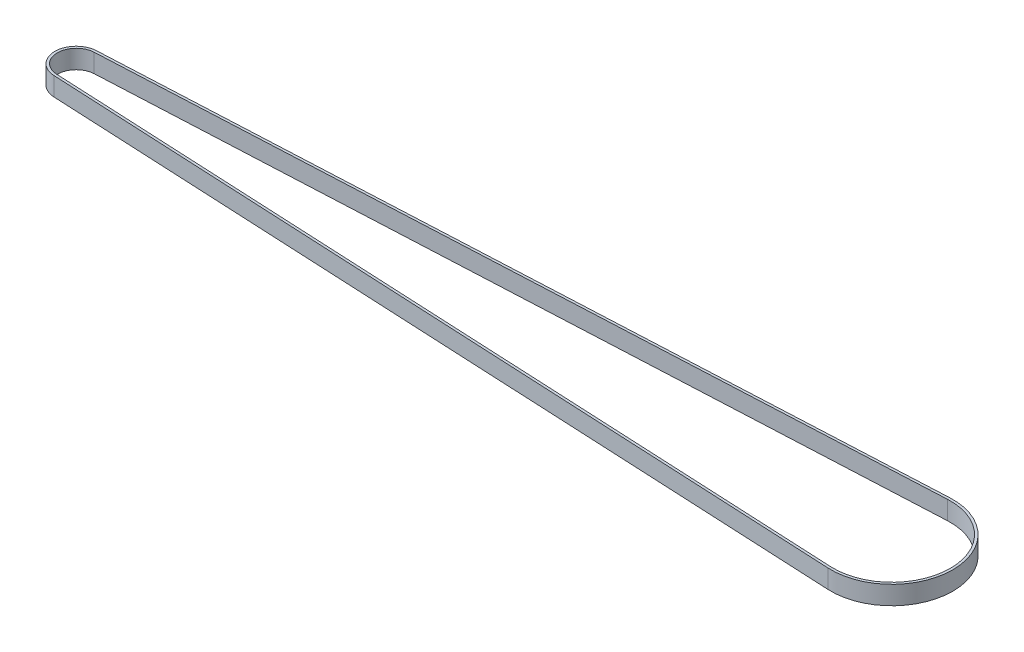
ISO-10303-21;
HEADER;
FILE_DESCRIPTION(('STEP AP214'),'2;1');
FILE_NAME('part.step','',(''),(''),'','','');
FILE_SCHEMA(('AUTOMOTIVE_DESIGN { 1 0 10303 214 1 1 1 1 }'));
ENDSEC;
DATA;
#1=APPLICATION_CONTEXT('core data for automotive mechanical design processes');
#2=APPLICATION_PROTOCOL_DEFINITION('international standard','automotive_design',2000,#1);
#3=PRODUCT_CONTEXT('',#1,'mechanical');
#4=PRODUCT('Part','Part','',(#3));
#5=PRODUCT_RELATED_PRODUCT_CATEGORY('part','',(#4));
#6=PRODUCT_DEFINITION_FORMATION('','',#4);
#7=PRODUCT_DEFINITION_CONTEXT('part definition',#1,'design');
#8=PRODUCT_DEFINITION('design','',#6,#7);
#9=PRODUCT_DEFINITION_SHAPE('','',#8);
#10=(LENGTH_UNIT() NAMED_UNIT(*) SI_UNIT(.MILLI.,.METRE.));
#11=(NAMED_UNIT(*) PLANE_ANGLE_UNIT() SI_UNIT($,.RADIAN.));
#12=(NAMED_UNIT(*) SI_UNIT($,.STERADIAN.) SOLID_ANGLE_UNIT());
#13=UNCERTAINTY_MEASURE_WITH_UNIT(LENGTH_MEASURE(1.E-05),#10,'distance_accuracy_value','');
#14=(GEOMETRIC_REPRESENTATION_CONTEXT(3) GLOBAL_UNCERTAINTY_ASSIGNED_CONTEXT((#13)) GLOBAL_UNIT_ASSIGNED_CONTEXT((#10,
#11,#12)) REPRESENTATION_CONTEXT('',''));
#15=CARTESIAN_POINT('',(0.,0.,0.));
#16=DIRECTION('',(0.,0.,1.));
#17=DIRECTION('',(1.,0.,0.));
#18=AXIS2_PLACEMENT_3D('',#15,#16,#17);
#19=CARTESIAN_POINT('',(263.,6.,0.));
#20=DIRECTION('',(0.,-1.,0.));
#21=DIRECTION('',(0.,0.,-1.));
#22=AXIS2_PLACEMENT_3D('',#19,#20,#21);
#23=PLANE('',#22);
#24=CARTESIAN_POINT('',(263.,6.,0.));
#25=DIRECTION('',(0.,1.,0.));
#26=DIRECTION('',(0.,0.,-1.));
#27=AXIS2_PLACEMENT_3D('',#24,#25,#26);
#28=CIRCLE('',#27,19.65);
#29=CARTESIAN_POINT('',(262.047385931559,6.,19.6268954864647));
#30=VERTEX_POINT('',#29);
#31=CARTESIAN_POINT('',(262.047385931559,6.,-19.6268954864647));
#32=VERTEX_POINT('',#31);
#33=EDGE_CURVE('E139',#30,#32,#28,.T.);
#34=ORIENTED_EDGE('',*,*,#33,.T.);
#35=DIRECTION('',(-0.998824197784463,0.,0.0484790874524715));
#36=VECTOR('',#35,1.);
#37=CARTESIAN_POINT('',(-0.334505703422054,6.,-6.89188696471279));
#38=LINE('',#37,#36);
#39=CARTESIAN_POINT('',(-0.334505703422054,6.,-6.89188696471279));
#40=VERTEX_POINT('',#39);
#41=EDGE_CURVE('E142',#32,#40,#38,.T.);
#42=ORIENTED_EDGE('',*,*,#41,.T.);
#43=CARTESIAN_POINT('',(0.,6.,0.));
#44=DIRECTION('',(0.,1.,0.));
#45=DIRECTION('',(0.,0.,1.));
#46=AXIS2_PLACEMENT_3D('',#43,#44,#45);
#47=CIRCLE('',#46,6.9);
#48=CARTESIAN_POINT('',(-0.334505703422057,6.,6.89188696471279));
#49=VERTEX_POINT('',#48);
#50=EDGE_CURVE('E145',#40,#49,#47,.T.);
#51=ORIENTED_EDGE('',*,*,#50,.T.);
#52=DIRECTION('',(0.998824197784463,0.,0.0484790874524715));
#53=VECTOR('',#52,1.);
#54=CARTESIAN_POINT('',(-0.334505703422053,6.,6.89188696471279));
#55=LINE('',#54,#53);
#56=EDGE_CURVE('E147',#49,#30,#55,.T.);
#57=ORIENTED_EDGE('',*,*,#56,.T.);
#58=EDGE_LOOP('',(#34,#42,#51,#57));
#59=FACE_BOUND('',#58,.T.);
#60=CARTESIAN_POINT('',(0.,6.,0.));
#61=DIRECTION('',(0.,1.,0.));
#62=DIRECTION('',(0.,0.,1.));
#63=AXIS2_PLACEMENT_3D('',#60,#61,#62);
#64=CIRCLE('',#63,6.1);
#65=CARTESIAN_POINT('',(-0.295722433460076,6.,-6.09282760648522));
#66=VERTEX_POINT('',#65);
#67=CARTESIAN_POINT('',(-0.295722433460076,6.,6.09282760648522));
#68=VERTEX_POINT('',#67);
#69=EDGE_CURVE('E103',#66,#68,#64,.T.);
#70=ORIENTED_EDGE('',*,*,#69,.F.);
#71=DIRECTION('',(-0.998824197784463,0.,0.0484790874524715));
#72=VECTOR('',#71,1.);
#73=CARTESIAN_POINT('',(-0.295722433460076,6.,-6.09282760648522));
#74=LINE('',#73,#72);
#75=CARTESIAN_POINT('',(262.086169201521,6.,-18.8278361282371));
#76=VERTEX_POINT('',#75);
#77=EDGE_CURVE('E125',#76,#66,#74,.T.);
#78=ORIENTED_EDGE('',*,*,#77,.F.);
#79=CARTESIAN_POINT('',(263.,6.,0.));
#80=DIRECTION('',(0.,1.,0.));
#81=DIRECTION('',(0.,0.,-1.));
#82=AXIS2_PLACEMENT_3D('',#79,#80,#81);
#83=CIRCLE('',#82,18.85);
#84=CARTESIAN_POINT('',(262.086169201521,6.,18.8278361282371));
#85=VERTEX_POINT('',#84);
#86=EDGE_CURVE('E123',#85,#76,#83,.T.);
#87=ORIENTED_EDGE('',*,*,#86,.F.);
#88=DIRECTION('',(0.998824197784463,0.,0.0484790874524715));
#89=VECTOR('',#88,1.);
#90=CARTESIAN_POINT('',(-0.295722433460076,6.,6.09282760648522));
#91=LINE('',#90,#89);
#92=EDGE_CURVE('E111',#68,#85,#91,.T.);
#93=ORIENTED_EDGE('',*,*,#92,.F.);
#94=EDGE_LOOP('',(#70,#78,#87,#93));
#95=FACE_BOUND('',#94,.T.);
#96=ADVANCED_FACE('F38',(#59,#95),#23,.F.);
#97=CARTESIAN_POINT('',(263.,0.,0.));
#98=DIRECTION('',(0.,-1.,0.));
#99=DIRECTION('',(0.,0.,-1.));
#100=AXIS2_PLACEMENT_3D('',#97,#98,#99);
#101=PLANE('',#100);
#102=CARTESIAN_POINT('',(263.,0.,0.));
#103=DIRECTION('',(0.,1.,0.));
#104=DIRECTION('',(0.,0.,-1.));
#105=AXIS2_PLACEMENT_3D('',#102,#103,#104);
#106=CIRCLE('',#105,19.65);
#107=CARTESIAN_POINT('',(262.047385931559,0.,19.6268954864647));
#108=VERTEX_POINT('',#107);
#109=CARTESIAN_POINT('',(262.047385931559,0.,-19.6268954864647));
#110=VERTEX_POINT('',#109);
#111=EDGE_CURVE('E119',#108,#110,#106,.T.);
#112=ORIENTED_EDGE('',*,*,#111,.F.);
#113=DIRECTION('',(0.998824197784463,0.,0.0484790874524715));
#114=VECTOR('',#113,1.);
#115=CARTESIAN_POINT('',(-0.334505703422053,0.,6.89188696471279));
#116=LINE('',#115,#114);
#117=CARTESIAN_POINT('',(-0.334505703422057,0.,6.89188696471279));
#118=VERTEX_POINT('',#117);
#119=EDGE_CURVE('E143',#118,#108,#116,.T.);
#120=ORIENTED_EDGE('',*,*,#119,.F.);
#121=CARTESIAN_POINT('',(0.,0.,0.));
#122=DIRECTION('',(0.,1.,0.));
#123=DIRECTION('',(0.,0.,1.));
#124=AXIS2_PLACEMENT_3D('',#121,#122,#123);
#125=CIRCLE('',#124,6.9);
#126=CARTESIAN_POINT('',(-0.334505703422054,0.,-6.89188696471279));
#127=VERTEX_POINT('',#126);
#128=EDGE_CURVE('E154',#127,#118,#125,.T.);
#129=ORIENTED_EDGE('',*,*,#128,.F.);
#130=DIRECTION('',(-0.998824197784463,0.,0.0484790874524715));
#131=VECTOR('',#130,1.);
#132=CARTESIAN_POINT('',(-0.334505703422054,0.,-6.89188696471279));
#133=LINE('',#132,#131);
#134=EDGE_CURVE('E152',#110,#127,#133,.T.);
#135=ORIENTED_EDGE('',*,*,#134,.F.);
#136=EDGE_LOOP('',(#112,#120,#129,#135));
#137=FACE_BOUND('',#136,.T.);
#138=DIRECTION('',(-0.998824197784463,0.,0.0484790874524715));
#139=VECTOR('',#138,1.);
#140=CARTESIAN_POINT('',(-0.295722433460076,0.,-6.09282760648522));
#141=LINE('',#140,#139);
#142=CARTESIAN_POINT('',(262.086169201521,0.,-18.8278361282371));
#143=VERTEX_POINT('',#142);
#144=CARTESIAN_POINT('',(-0.295722433460099,0.,-6.09282760648522));
#145=VERTEX_POINT('',#144);
#146=EDGE_CURVE('E112',#143,#145,#141,.T.);
#147=ORIENTED_EDGE('',*,*,#146,.T.);
#148=CARTESIAN_POINT('',(0.,0.,0.));
#149=DIRECTION('',(0.,1.,0.));
#150=DIRECTION('',(0.,0.,1.));
#151=AXIS2_PLACEMENT_3D('',#148,#149,#150);
#152=CIRCLE('',#151,6.1);
#153=CARTESIAN_POINT('',(-0.295722433460076,0.,6.09282760648522));
#154=VERTEX_POINT('',#153);
#155=EDGE_CURVE('E61',#145,#154,#152,.T.);
#156=ORIENTED_EDGE('',*,*,#155,.T.);
#157=DIRECTION('',(0.998824197784463,0.,0.0484790874524715));
#158=VECTOR('',#157,1.);
#159=CARTESIAN_POINT('',(-0.295722433460076,0.,6.09282760648522));
#160=LINE('',#159,#158);
#161=CARTESIAN_POINT('',(262.086169201521,0.,18.8278361282371));
#162=VERTEX_POINT('',#161);
#163=EDGE_CURVE('E118',#154,#162,#160,.T.);
#164=ORIENTED_EDGE('',*,*,#163,.T.);
#165=CARTESIAN_POINT('',(263.,0.,0.));
#166=DIRECTION('',(0.,1.,0.));
#167=DIRECTION('',(0.,0.,-1.));
#168=AXIS2_PLACEMENT_3D('',#165,#166,#167);
#169=CIRCLE('',#168,18.85);
#170=EDGE_CURVE('E131',#162,#143,#169,.T.);
#171=ORIENTED_EDGE('',*,*,#170,.T.);
#172=EDGE_LOOP('',(#147,#156,#164,#171));
#173=FACE_BOUND('',#172,.T.);
#174=ADVANCED_FACE('F172',(#137,#173),#101,.T.);
#175=CARTESIAN_POINT('',(263.,6.,0.));
#176=DIRECTION('',(0.,-1.,0.));
#177=DIRECTION('',(0.,0.,-1.));
#178=AXIS2_PLACEMENT_3D('',#175,#176,#177);
#179=CYLINDRICAL_SURFACE('',#178,19.65);
#180=ORIENTED_EDGE('',*,*,#111,.T.);
#181=DIRECTION('',(0.,-1.,0.));
#182=VECTOR('',#181,1.);
#183=CARTESIAN_POINT('',(262.047385931559,6.,-19.6268954864647));
#184=LINE('',#183,#182);
#185=EDGE_CURVE('E11',#32,#110,#184,.T.);
#186=ORIENTED_EDGE('',*,*,#185,.F.);
#187=ORIENTED_EDGE('',*,*,#33,.F.);
#188=DIRECTION('',(0.,-1.,0.));
#189=VECTOR('',#188,1.);
#190=CARTESIAN_POINT('',(262.047385931559,6.,19.6268954864647));
#191=LINE('',#190,#189);
#192=EDGE_CURVE('E149',#30,#108,#191,.T.);
#193=ORIENTED_EDGE('',*,*,#192,.T.);
#194=EDGE_LOOP('',(#180,#186,#187,#193));
#195=FACE_BOUND('',#194,.T.);
#196=ADVANCED_FACE('F40',(#195),#179,.T.);
#197=CARTESIAN_POINT('',(-0.334505703422054,6.,-6.89188696471279));
#198=DIRECTION('',(0.0484790874524715,0.,0.998824197784463));
#199=DIRECTION('',(0.998824197784463,0.,-0.0484790874524715));
#200=AXIS2_PLACEMENT_3D('',#197,#198,#199);
#201=PLANE('',#200);
#202=ORIENTED_EDGE('',*,*,#134,.T.);
#203=DIRECTION('',(0.,-1.,0.));
#204=VECTOR('',#203,1.);
#205=CARTESIAN_POINT('',(-0.334505703422054,6.,-6.89188696471279));
#206=LINE('',#205,#204);
#207=EDGE_CURVE('E46',#40,#127,#206,.T.);
#208=ORIENTED_EDGE('',*,*,#207,.F.);
#209=ORIENTED_EDGE('',*,*,#41,.F.);
#210=ORIENTED_EDGE('',*,*,#185,.T.);
#211=EDGE_LOOP('',(#202,#208,#209,#210));
#212=FACE_BOUND('',#211,.T.);
#213=ADVANCED_FACE('F182',(#212),#201,.F.);
#214=CARTESIAN_POINT('',(0.,6.,0.));
#215=DIRECTION('',(0.,-1.,0.));
#216=DIRECTION('',(0.,0.,-1.));
#217=AXIS2_PLACEMENT_3D('',#214,#215,#216);
#218=CYLINDRICAL_SURFACE('',#217,6.9);
#219=ORIENTED_EDGE('',*,*,#128,.T.);
#220=DIRECTION('',(0.,-1.,0.));
#221=VECTOR('',#220,1.);
#222=CARTESIAN_POINT('',(-0.334505703422057,6.,6.89188696471279));
#223=LINE('',#222,#221);
#224=EDGE_CURVE('E159',#49,#118,#223,.T.);
#225=ORIENTED_EDGE('',*,*,#224,.F.);
#226=ORIENTED_EDGE('',*,*,#50,.F.);
#227=ORIENTED_EDGE('',*,*,#207,.T.);
#228=EDGE_LOOP('',(#219,#225,#226,#227));
#229=FACE_BOUND('',#228,.T.);
#230=ADVANCED_FACE('F166',(#229),#218,.T.);
#231=CARTESIAN_POINT('',(-0.334505703422053,6.,6.89188696471279));
#232=DIRECTION('',(0.0484790874524715,0.,-0.998824197784463));
#233=DIRECTION('',(-0.998824197784463,0.,-0.0484790874524715));
#234=AXIS2_PLACEMENT_3D('',#231,#232,#233);
#235=PLANE('',#234);
#236=ORIENTED_EDGE('',*,*,#119,.T.);
#237=ORIENTED_EDGE('',*,*,#192,.F.);
#238=ORIENTED_EDGE('',*,*,#56,.F.);
#239=ORIENTED_EDGE('',*,*,#224,.T.);
#240=EDGE_LOOP('',(#236,#237,#238,#239));
#241=FACE_BOUND('',#240,.T.);
#242=ADVANCED_FACE('F176',(#241),#235,.F.);
#243=CARTESIAN_POINT('',(0.,6.,0.));
#244=DIRECTION('',(0.,-1.,0.));
#245=DIRECTION('',(0.,0.,-1.));
#246=AXIS2_PLACEMENT_3D('',#243,#244,#245);
#247=CYLINDRICAL_SURFACE('',#246,6.1);
#248=ORIENTED_EDGE('',*,*,#155,.F.);
#249=DIRECTION('',(0.,-1.,0.));
#250=VECTOR('',#249,1.);
#251=CARTESIAN_POINT('',(-0.295722433460076,6.,-6.09282760648522));
#252=LINE('',#251,#250);
#253=EDGE_CURVE('E107',#66,#145,#252,.T.);
#254=ORIENTED_EDGE('',*,*,#253,.F.);
#255=ORIENTED_EDGE('',*,*,#69,.T.);
#256=DIRECTION('',(0.,-1.,0.));
#257=VECTOR('',#256,1.);
#258=CARTESIAN_POINT('',(-0.295722433460076,6.,6.09282760648522));
#259=LINE('',#258,#257);
#260=EDGE_CURVE('E106',#68,#154,#259,.T.);
#261=ORIENTED_EDGE('',*,*,#260,.T.);
#262=EDGE_LOOP('',(#248,#254,#255,#261));
#263=FACE_BOUND('',#262,.T.);
#264=ADVANCED_FACE('F105',(#263),#247,.F.);
#265=CARTESIAN_POINT('',(-0.295722433460076,6.,6.09282760648522));
#266=DIRECTION('',(0.0484790874524715,0.,-0.998824197784463));
#267=DIRECTION('',(-0.998824197784463,0.,-0.0484790874524715));
#268=AXIS2_PLACEMENT_3D('',#265,#266,#267);
#269=PLANE('',#268);
#270=ORIENTED_EDGE('',*,*,#163,.F.);
#271=ORIENTED_EDGE('',*,*,#260,.F.);
#272=ORIENTED_EDGE('',*,*,#92,.T.);
#273=DIRECTION('',(0.,-1.,0.));
#274=VECTOR('',#273,1.);
#275=CARTESIAN_POINT('',(262.086169201521,6.,18.8278361282371));
#276=LINE('',#275,#274);
#277=EDGE_CURVE('E120',#85,#162,#276,.T.);
#278=ORIENTED_EDGE('',*,*,#277,.T.);
#279=EDGE_LOOP('',(#270,#271,#272,#278));
#280=FACE_BOUND('',#279,.T.);
#281=ADVANCED_FACE('F115',(#280),#269,.T.);
#282=CARTESIAN_POINT('',(263.,6.,0.));
#283=DIRECTION('',(0.,-1.,0.));
#284=DIRECTION('',(0.,0.,-1.));
#285=AXIS2_PLACEMENT_3D('',#282,#283,#284);
#286=CYLINDRICAL_SURFACE('',#285,18.85);
#287=ORIENTED_EDGE('',*,*,#170,.F.);
#288=ORIENTED_EDGE('',*,*,#277,.F.);
#289=ORIENTED_EDGE('',*,*,#86,.T.);
#290=DIRECTION('',(0.,-1.,0.));
#291=VECTOR('',#290,1.);
#292=CARTESIAN_POINT('',(262.086169201521,6.,-18.8278361282371));
#293=LINE('',#292,#291);
#294=EDGE_CURVE('E53',#76,#143,#293,.T.);
#295=ORIENTED_EDGE('',*,*,#294,.T.);
#296=EDGE_LOOP('',(#287,#288,#289,#295));
#297=FACE_BOUND('',#296,.T.);
#298=ADVANCED_FACE('F205',(#297),#286,.F.);
#299=CARTESIAN_POINT('',(-0.295722433460076,6.,-6.09282760648522));
#300=DIRECTION('',(0.0484790874524715,0.,0.998824197784463));
#301=DIRECTION('',(0.998824197784463,0.,-0.0484790874524715));
#302=AXIS2_PLACEMENT_3D('',#299,#300,#301);
#303=PLANE('',#302);
#304=ORIENTED_EDGE('',*,*,#146,.F.);
#305=ORIENTED_EDGE('',*,*,#294,.F.);
#306=ORIENTED_EDGE('',*,*,#77,.T.);
#307=ORIENTED_EDGE('',*,*,#253,.T.);
#308=EDGE_LOOP('',(#304,#305,#306,#307));
#309=FACE_BOUND('',#308,.T.);
#310=ADVANCED_FACE('F209',(#309),#303,.T.);
#311=CLOSED_SHELL('',(#96,#174,#196,#213,#230,#242,#264,#281,#298,#310));
#312=MANIFOLD_SOLID_BREP('B2',#311);
#313=ADVANCED_BREP_SHAPE_REPRESENTATION('',(#18,#312),#14);
#314=SHAPE_DEFINITION_REPRESENTATION(#9,#313);
ENDSEC;
END-ISO-10303-21;
